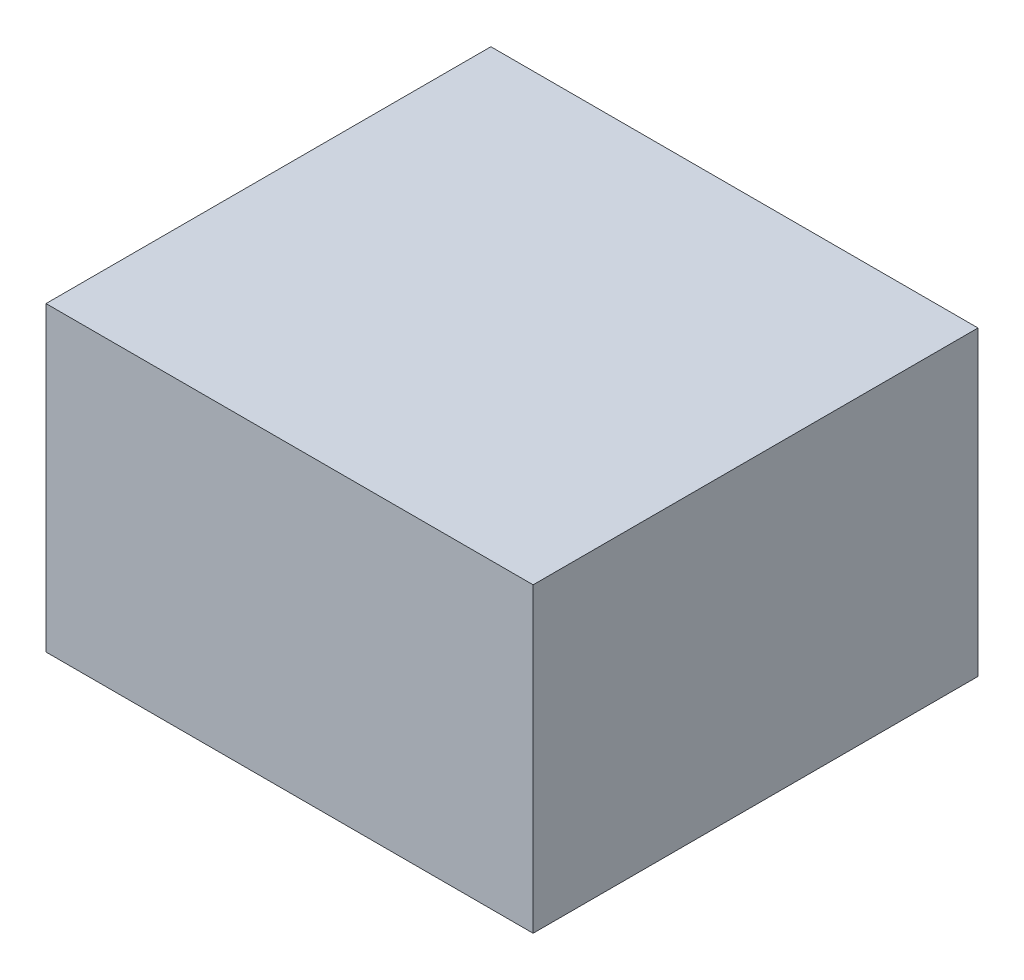
ISO-10303-21;
HEADER;
FILE_DESCRIPTION(('STEP AP214'),'2;1');
FILE_NAME('part.step','',(''),(''),'','','');
FILE_SCHEMA(('AUTOMOTIVE_DESIGN { 1 0 10303 214 1 1 1 1 }'));
ENDSEC;
DATA;
#1=APPLICATION_CONTEXT('core data for automotive mechanical design processes');
#2=APPLICATION_PROTOCOL_DEFINITION('international standard','automotive_design',2000,#1);
#3=PRODUCT_CONTEXT('',#1,'mechanical');
#4=PRODUCT('Part','Part','',(#3));
#5=PRODUCT_RELATED_PRODUCT_CATEGORY('part','',(#4));
#6=PRODUCT_DEFINITION_FORMATION('','',#4);
#7=PRODUCT_DEFINITION_CONTEXT('part definition',#1,'design');
#8=PRODUCT_DEFINITION('design','',#6,#7);
#9=PRODUCT_DEFINITION_SHAPE('','',#8);
#10=(LENGTH_UNIT() NAMED_UNIT(*) SI_UNIT(.MILLI.,.METRE.));
#11=(NAMED_UNIT(*) PLANE_ANGLE_UNIT() SI_UNIT($,.RADIAN.));
#12=(NAMED_UNIT(*) SI_UNIT($,.STERADIAN.) SOLID_ANGLE_UNIT());
#13=UNCERTAINTY_MEASURE_WITH_UNIT(LENGTH_MEASURE(1.E-05),#10,'distance_accuracy_value','');
#14=(GEOMETRIC_REPRESENTATION_CONTEXT(3) GLOBAL_UNCERTAINTY_ASSIGNED_CONTEXT((#13)) GLOBAL_UNIT_ASSIGNED_CONTEXT((#10,
#11,#12)) REPRESENTATION_CONTEXT('',''));
#15=CARTESIAN_POINT('',(0.,0.,0.));
#16=DIRECTION('',(0.,0.,1.));
#17=DIRECTION('',(1.,0.,0.));
#18=AXIS2_PLACEMENT_3D('',#15,#16,#17);
#19=CARTESIAN_POINT('',(43.7995061123554,27.1350475578229,80.));
#20=DIRECTION('',(-1.,0.,0.));
#21=DIRECTION('',(0.,0.,1.));
#22=AXIS2_PLACEMENT_3D('',#19,#20,#21);
#23=PLANE('',#22);
#24=DIRECTION('',(0.,1.,0.));
#25=VECTOR('',#24,1.);
#26=CARTESIAN_POINT('',(43.7995061123554,27.1350475578229,0.));
#27=LINE('',#26,#25);
#28=CARTESIAN_POINT('',(43.7995061123554,-27.1350475578229,0.));
#29=VERTEX_POINT('',#28);
#30=CARTESIAN_POINT('',(43.7995061123554,27.1350475578229,0.));
#31=VERTEX_POINT('',#30);
#32=EDGE_CURVE('E113',#29,#31,#27,.T.);
#33=ORIENTED_EDGE('',*,*,#32,.T.);
#34=DIRECTION('',(0.,0.,-1.));
#35=VECTOR('',#34,1.);
#36=CARTESIAN_POINT('',(43.7995061123554,27.1350475578229,80.));
#37=LINE('',#36,#35);
#38=CARTESIAN_POINT('',(43.7995061123554,27.1350475578229,80.));
#39=VERTEX_POINT('',#38);
#40=EDGE_CURVE('E11',#39,#31,#37,.T.);
#41=ORIENTED_EDGE('',*,*,#40,.F.);
#42=DIRECTION('',(0.,1.,0.));
#43=VECTOR('',#42,1.);
#44=CARTESIAN_POINT('',(43.7995061123554,27.1350475578229,80.));
#45=LINE('',#44,#43);
#46=CARTESIAN_POINT('',(43.7995061123554,-27.1350475578229,80.));
#47=VERTEX_POINT('',#46);
#48=EDGE_CURVE('E97',#47,#39,#45,.T.);
#49=ORIENTED_EDGE('',*,*,#48,.F.);
#50=DIRECTION('',(0.,0.,-1.));
#51=VECTOR('',#50,1.);
#52=CARTESIAN_POINT('',(43.7995061123554,-27.1350475578229,80.));
#53=LINE('',#52,#51);
#54=EDGE_CURVE('E109',#47,#29,#53,.T.);
#55=ORIENTED_EDGE('',*,*,#54,.T.);
#56=EDGE_LOOP('',(#33,#41,#49,#55));
#57=FACE_BOUND('',#56,.T.);
#58=ADVANCED_FACE('F45',(#57),#23,.F.);
#59=CARTESIAN_POINT('',(-43.7995061123554,27.1350475578229,80.));
#60=DIRECTION('',(0.,-1.,0.));
#61=DIRECTION('',(0.,0.,-1.));
#62=AXIS2_PLACEMENT_3D('',#59,#60,#61);
#63=PLANE('',#62);
#64=DIRECTION('',(-1.,0.,0.));
#65=VECTOR('',#64,1.);
#66=CARTESIAN_POINT('',(-43.7995061123554,27.1350475578229,0.));
#67=LINE('',#66,#65);
#68=CARTESIAN_POINT('',(-43.7995061123554,27.1350475578229,0.));
#69=VERTEX_POINT('',#68);
#70=EDGE_CURVE('E102',#31,#69,#67,.T.);
#71=ORIENTED_EDGE('',*,*,#70,.T.);
#72=DIRECTION('',(0.,0.,-1.));
#73=VECTOR('',#72,1.);
#74=CARTESIAN_POINT('',(-43.7995061123554,27.1350475578229,80.));
#75=LINE('',#74,#73);
#76=CARTESIAN_POINT('',(-43.7995061123554,27.1350475578229,80.));
#77=VERTEX_POINT('',#76);
#78=EDGE_CURVE('E54',#77,#69,#75,.T.);
#79=ORIENTED_EDGE('',*,*,#78,.F.);
#80=DIRECTION('',(-1.,0.,0.));
#81=VECTOR('',#80,1.);
#82=CARTESIAN_POINT('',(-43.7995061123554,27.1350475578229,80.));
#83=LINE('',#82,#81);
#84=EDGE_CURVE('E92',#39,#77,#83,.T.);
#85=ORIENTED_EDGE('',*,*,#84,.F.);
#86=ORIENTED_EDGE('',*,*,#40,.T.);
#87=EDGE_LOOP('',(#71,#79,#85,#86));
#88=FACE_BOUND('',#87,.T.);
#89=ADVANCED_FACE('F101',(#88),#63,.F.);
#90=CARTESIAN_POINT('',(-43.7995061123554,27.1350475578229,80.));
#91=DIRECTION('',(1.,0.,0.));
#92=DIRECTION('',(0.,0.,-1.));
#93=AXIS2_PLACEMENT_3D('',#90,#91,#92);
#94=PLANE('',#93);
#95=DIRECTION('',(0.,-1.,0.));
#96=VECTOR('',#95,1.);
#97=CARTESIAN_POINT('',(-43.7995061123554,27.1350475578229,0.));
#98=LINE('',#97,#96);
#99=CARTESIAN_POINT('',(-43.7995061123554,-27.1350475578229,0.));
#100=VERTEX_POINT('',#99);
#101=EDGE_CURVE('E79',#69,#100,#98,.T.);
#102=ORIENTED_EDGE('',*,*,#101,.T.);
#103=DIRECTION('',(0.,0.,-1.));
#104=VECTOR('',#103,1.);
#105=CARTESIAN_POINT('',(-43.7995061123554,-27.1350475578229,80.));
#106=LINE('',#105,#104);
#107=CARTESIAN_POINT('',(-43.7995061123554,-27.1350475578229,80.));
#108=VERTEX_POINT('',#107);
#109=EDGE_CURVE('E104',#108,#100,#106,.T.);
#110=ORIENTED_EDGE('',*,*,#109,.F.);
#111=DIRECTION('',(0.,-1.,0.));
#112=VECTOR('',#111,1.);
#113=CARTESIAN_POINT('',(-43.7995061123554,27.1350475578229,80.));
#114=LINE('',#113,#112);
#115=EDGE_CURVE('E95',#77,#108,#114,.T.);
#116=ORIENTED_EDGE('',*,*,#115,.F.);
#117=ORIENTED_EDGE('',*,*,#78,.T.);
#118=EDGE_LOOP('',(#102,#110,#116,#117));
#119=FACE_BOUND('',#118,.T.);
#120=ADVANCED_FACE('F105',(#119),#94,.F.);
#121=CARTESIAN_POINT('',(-43.7995061123554,-27.1350475578229,80.));
#122=DIRECTION('',(0.,1.,0.));
#123=DIRECTION('',(0.,0.,1.));
#124=AXIS2_PLACEMENT_3D('',#121,#122,#123);
#125=PLANE('',#124);
#126=DIRECTION('',(1.,0.,0.));
#127=VECTOR('',#126,1.);
#128=CARTESIAN_POINT('',(-43.7995061123554,-27.1350475578229,0.));
#129=LINE('',#128,#127);
#130=EDGE_CURVE('E85',#100,#29,#129,.T.);
#131=ORIENTED_EDGE('',*,*,#130,.T.);
#132=ORIENTED_EDGE('',*,*,#54,.F.);
#133=DIRECTION('',(1.,0.,0.));
#134=VECTOR('',#133,1.);
#135=CARTESIAN_POINT('',(-43.7995061123554,-27.1350475578229,80.));
#136=LINE('',#135,#134);
#137=EDGE_CURVE('E62',#108,#47,#136,.T.);
#138=ORIENTED_EDGE('',*,*,#137,.F.);
#139=ORIENTED_EDGE('',*,*,#109,.T.);
#140=EDGE_LOOP('',(#131,#132,#138,#139));
#141=FACE_BOUND('',#140,.T.);
#142=ADVANCED_FACE('F126',(#141),#125,.F.);
#143=CARTESIAN_POINT('',(0.,0.,80.));
#144=DIRECTION('',(0.,0.,1.));
#145=DIRECTION('',(1.,0.,0.));
#146=AXIS2_PLACEMENT_3D('',#143,#144,#145);
#147=PLANE('',#146);
#148=ORIENTED_EDGE('',*,*,#48,.T.);
#149=ORIENTED_EDGE('',*,*,#84,.T.);
#150=ORIENTED_EDGE('',*,*,#115,.T.);
#151=ORIENTED_EDGE('',*,*,#137,.T.);
#152=EDGE_LOOP('',(#148,#149,#150,#151));
#153=FACE_BOUND('',#152,.T.);
#154=ADVANCED_FACE('F93',(#153),#147,.T.);
#155=CARTESIAN_POINT('',(0.,0.,0.));
#156=DIRECTION('',(0.,0.,1.));
#157=DIRECTION('',(1.,0.,0.));
#158=AXIS2_PLACEMENT_3D('',#155,#156,#157);
#159=PLANE('',#158);
#160=ORIENTED_EDGE('',*,*,#32,.F.);
#161=ORIENTED_EDGE('',*,*,#130,.F.);
#162=ORIENTED_EDGE('',*,*,#101,.F.);
#163=ORIENTED_EDGE('',*,*,#70,.F.);
#164=EDGE_LOOP('',(#160,#161,#162,#163));
#165=FACE_BOUND('',#164,.T.);
#166=ADVANCED_FACE('F129',(#165),#159,.F.);
#167=CLOSED_SHELL('',(#58,#89,#120,#142,#154,#166));
#168=MANIFOLD_SOLID_BREP('B2',#167);
#169=ADVANCED_BREP_SHAPE_REPRESENTATION('',(#18,#168),#14);
#170=SHAPE_DEFINITION_REPRESENTATION(#9,#169);
ENDSEC;
END-ISO-10303-21;
